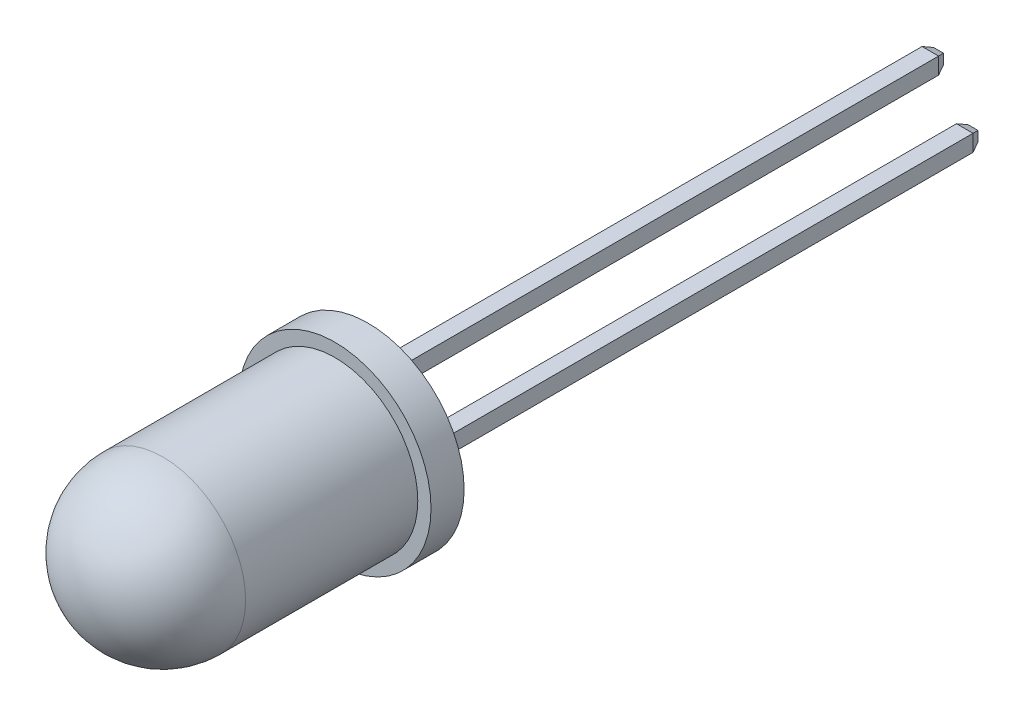
ISO-10303-21;
HEADER;
FILE_DESCRIPTION(('STEP AP214'),'2;1');
FILE_NAME('part.step','',(''),(''),'','','');
FILE_SCHEMA(('AUTOMOTIVE_DESIGN { 1 0 10303 214 1 1 1 1 }'));
ENDSEC;
DATA;
#1=APPLICATION_CONTEXT('core data for automotive mechanical design processes');
#2=APPLICATION_PROTOCOL_DEFINITION('international standard','automotive_design',2000,#1);
#3=PRODUCT_CONTEXT('',#1,'mechanical');
#4=PRODUCT('Part','Part','',(#3));
#5=PRODUCT_RELATED_PRODUCT_CATEGORY('part','',(#4));
#6=PRODUCT_DEFINITION_FORMATION('','',#4);
#7=PRODUCT_DEFINITION_CONTEXT('part definition',#1,'design');
#8=PRODUCT_DEFINITION('design','',#6,#7);
#9=PRODUCT_DEFINITION_SHAPE('','',#8);
#10=(LENGTH_UNIT() NAMED_UNIT(*) SI_UNIT(.MILLI.,.METRE.));
#11=(NAMED_UNIT(*) PLANE_ANGLE_UNIT() SI_UNIT($,.RADIAN.));
#12=(NAMED_UNIT(*) SI_UNIT($,.STERADIAN.) SOLID_ANGLE_UNIT());
#13=UNCERTAINTY_MEASURE_WITH_UNIT(LENGTH_MEASURE(1.E-05),#10,'distance_accuracy_value','');
#14=(GEOMETRIC_REPRESENTATION_CONTEXT(3) GLOBAL_UNCERTAINTY_ASSIGNED_CONTEXT((#13)) GLOBAL_UNIT_ASSIGNED_CONTEXT((#10,
#11,#12)) REPRESENTATION_CONTEXT('',''));
#15=CARTESIAN_POINT('',(0.,0.,0.));
#16=DIRECTION('',(0.,0.,1.));
#17=DIRECTION('',(1.,0.,0.));
#18=AXIS2_PLACEMENT_3D('',#15,#16,#17);
#19=CARTESIAN_POINT('',(0.,0.,0.));
#20=DIRECTION('',(0.,0.,1.));
#21=DIRECTION('',(1.,0.,0.));
#22=AXIS2_PLACEMENT_3D('',#19,#20,#21);
#23=SPHERICAL_SURFACE('',#22,2.5);
#24=CARTESIAN_POINT('',(0.,0.,0.));
#25=DIRECTION('',(0.,0.,-1.));
#26=DIRECTION('',(1.,0.,0.));
#27=AXIS2_PLACEMENT_3D('',#24,#25,#26);
#28=CIRCLE('',#27,2.5);
#29=CARTESIAN_POINT('',(-2.5,0.,0.));
#30=VERTEX_POINT('',#29);
#31=CARTESIAN_POINT('',(2.5,0.,0.));
#32=VERTEX_POINT('',#31);
#33=EDGE_CURVE('P0_E26',#30,#32,#28,.T.);
#34=ORIENTED_EDGE('',*,*,#33,.F.);
#35=CARTESIAN_POINT('',(0.,0.,0.));
#36=DIRECTION('',(0.,-1.,0.));
#37=DIRECTION('',(-1.,0.,0.));
#38=AXIS2_PLACEMENT_3D('',#35,#36,#37);
#39=CIRCLE('',#38,2.5);
#40=CARTESIAN_POINT('',(0.,0.,2.5));
#41=VERTEX_POINT('',#40);
#42=EDGE_CURVE('P0_E11',#41,#30,#39,.T.);
#43=ORIENTED_EDGE('',*,*,#42,.F.);
#44=ORIENTED_EDGE('',*,*,#42,.T.);
#45=CARTESIAN_POINT('',(0.,0.,0.));
#46=DIRECTION('',(0.,0.,-1.));
#47=DIRECTION('',(1.,0.,0.));
#48=AXIS2_PLACEMENT_3D('',#45,#46,#47);
#49=CIRCLE('',#48,2.5);
#50=EDGE_CURVE('P0_E70',#32,#30,#49,.T.);
#51=ORIENTED_EDGE('',*,*,#50,.F.);
#52=EDGE_LOOP('',(#34,#43,#44,#51));
#53=FACE_BOUND('',#52,.T.);
#54=ADVANCED_FACE('P0_F16',(#53),#23,.T.);
#55=CARTESIAN_POINT('',(0.,0.,-2.6));
#56=DIRECTION('',(0.,0.,-1.));
#57=DIRECTION('',(-1.,0.,0.));
#58=AXIS2_PLACEMENT_3D('',#55,#56,#57);
#59=CYLINDRICAL_SURFACE('',#58,2.5);
#60=CARTESIAN_POINT('',(0.,0.,-5.2));
#61=DIRECTION('',(0.,0.,-1.));
#62=DIRECTION('',(1.,0.,0.));
#63=AXIS2_PLACEMENT_3D('',#60,#61,#62);
#64=CIRCLE('',#63,2.5);
#65=CARTESIAN_POINT('',(2.5,0.,-5.2));
#66=VERTEX_POINT('',#65);
#67=EDGE_CURVE('P0_E67',#66,#66,#64,.T.);
#68=ORIENTED_EDGE('',*,*,#67,.F.);
#69=DIRECTION('',(0.,0.,1.));
#70=VECTOR('',#69,1.);
#71=CARTESIAN_POINT('',(2.5,0.,-2.6));
#72=LINE('',#71,#70);
#73=EDGE_CURVE('P0_E64',#66,#32,#72,.T.);
#74=ORIENTED_EDGE('',*,*,#73,.T.);
#75=ORIENTED_EDGE('',*,*,#50,.T.);
#76=ORIENTED_EDGE('',*,*,#33,.T.);
#77=ORIENTED_EDGE('',*,*,#73,.F.);
#78=EDGE_LOOP('',(#68,#74,#75,#76,#77));
#79=FACE_BOUND('',#78,.T.);
#80=ADVANCED_FACE('P0_F66',(#79),#59,.T.);
#81=CARTESIAN_POINT('',(-2.9,0.,-5.2));
#82=DIRECTION('',(0.,0.,1.));
#83=DIRECTION('',(1.,0.,0.));
#84=AXIS2_PLACEMENT_3D('',#81,#82,#83);
#85=PLANE('',#84);
#86=ORIENTED_EDGE('',*,*,#67,.T.);
#87=EDGE_LOOP('',(#86));
#88=FACE_BOUND('',#87,.T.);
#89=CARTESIAN_POINT('',(0.,0.,-5.2));
#90=DIRECTION('',(0.,0.,-1.));
#91=DIRECTION('',(1.,0.,0.));
#92=AXIS2_PLACEMENT_3D('',#89,#90,#91);
#93=CIRCLE('',#92,2.9);
#94=CARTESIAN_POINT('',(2.9,0.,-5.2));
#95=VERTEX_POINT('',#94);
#96=EDGE_CURVE('P0_E20',#95,#95,#93,.T.);
#97=ORIENTED_EDGE('',*,*,#96,.F.);
#98=EDGE_LOOP('',(#97));
#99=FACE_BOUND('',#98,.T.);
#100=ADVANCED_FACE('P0_F18',(#88,#99),#85,.T.);
#101=CARTESIAN_POINT('',(0.,0.,-5.7));
#102=DIRECTION('',(0.,0.,-1.));
#103=DIRECTION('',(-1.,0.,0.));
#104=AXIS2_PLACEMENT_3D('',#101,#102,#103);
#105=CYLINDRICAL_SURFACE('',#104,2.9);
#106=CARTESIAN_POINT('',(0.,0.,-6.2));
#107=DIRECTION('',(0.,0.,-1.));
#108=DIRECTION('',(1.,0.,0.));
#109=AXIS2_PLACEMENT_3D('',#106,#107,#108);
#110=CIRCLE('',#109,2.9);
#111=CARTESIAN_POINT('',(2.9,0.,-6.2));
#112=VERTEX_POINT('',#111);
#113=EDGE_CURVE('P0_E86',#112,#112,#110,.T.);
#114=ORIENTED_EDGE('',*,*,#113,.F.);
#115=DIRECTION('',(0.,0.,1.));
#116=VECTOR('',#115,1.);
#117=CARTESIAN_POINT('',(2.9,0.,-5.7));
#118=LINE('',#117,#116);
#119=EDGE_CURVE('P0_E79',#112,#95,#118,.T.);
#120=ORIENTED_EDGE('',*,*,#119,.T.);
#121=ORIENTED_EDGE('',*,*,#96,.T.);
#122=ORIENTED_EDGE('',*,*,#119,.F.);
#123=EDGE_LOOP('',(#114,#120,#121,#122));
#124=FACE_BOUND('',#123,.T.);
#125=ADVANCED_FACE('P0_F93',(#124),#105,.T.);
#126=CARTESIAN_POINT('',(0.,0.,-6.2));
#127=DIRECTION('',(0.,0.,-1.));
#128=DIRECTION('',(0.,-1.,0.));
#129=AXIS2_PLACEMENT_3D('',#126,#127,#128);
#130=PLANE('',#129);
#131=ORIENTED_EDGE('',*,*,#113,.T.);
#132=EDGE_LOOP('',(#131));
#133=FACE_BOUND('',#132,.T.);
#134=ADVANCED_FACE('P0_F92',(#133),#130,.T.);
#135=CLOSED_SHELL('',(#54,#80,#100,#125,#134));
#136=MANIFOLD_SOLID_BREP('P0_B1',#135);
#137=CARTESIAN_POINT('',(-1.02,-0.249999953433879,-6.2));
#138=DIRECTION('',(0.,-1.,0.));
#139=DIRECTION('',(0.,0.,-1.));
#140=AXIS2_PLACEMENT_3D('',#137,#138,#139);
#141=PLANE('',#140);
#142=DIRECTION('',(-1.,0.,0.));
#143=VECTOR('',#142,1.);
#144=CARTESIAN_POINT('',(-1.145,-0.249999953433879,-24.45));
#145=LINE('',#144,#143);
#146=CARTESIAN_POINT('',(-1.02,-0.249999953433879,-24.45));
#147=VERTEX_POINT('',#146);
#148=CARTESIAN_POINT('',(-1.52,-0.249999953433879,-24.45));
#149=VERTEX_POINT('',#148);
#150=EDGE_CURVE('P1_E245',#147,#149,#145,.T.);
#151=ORIENTED_EDGE('',*,*,#150,.F.);
#152=DIRECTION('',(0.,0.,-1.));
#153=VECTOR('',#152,1.);
#154=CARTESIAN_POINT('',(-1.02,-0.249999953433879,-6.2));
#155=LINE('',#154,#153);
#156=CARTESIAN_POINT('',(-1.02,-0.249999953433879,-6.2));
#157=VERTEX_POINT('',#156);
#158=EDGE_CURVE('P1_E40',#157,#147,#155,.T.);
#159=ORIENTED_EDGE('',*,*,#158,.F.);
#160=DIRECTION('',(0.00909052693064519,0.,0.999958680306403));
#161=VECTOR('',#160,1.);
#162=CARTESIAN_POINT('',(-1.00000001490116,-0.25,-4.00000005960464));
#163=LINE('',#162,#161);
#164=CARTESIAN_POINT('',(-1.00000001490116,-0.25,-4.00000005960464));
#165=VERTEX_POINT('',#164);
#166=EDGE_CURVE('P1_E150',#157,#165,#163,.T.);
#167=ORIENTED_EDGE('',*,*,#166,.T.);
#168=DIRECTION('',(1.,0.,0.));
#169=VECTOR('',#168,1.);
#170=CARTESIAN_POINT('',(-0.279064603238777,-0.25,-4.00000005960464));
#171=LINE('',#170,#169);
#172=CARTESIAN_POINT('',(-0.279064603238777,-0.25,-4.00000005960464));
#173=VERTEX_POINT('',#172);
#174=EDGE_CURVE('P1_E167',#165,#173,#171,.T.);
#175=ORIENTED_EDGE('',*,*,#174,.T.);
#176=DIRECTION('',(-0.523156160420928,0.,0.852236840211471));
#177=VECTOR('',#176,1.);
#178=CARTESIAN_POINT('',(-0.999999977648259,-0.25,-2.82557503708544));
#179=LINE('',#178,#177);
#180=CARTESIAN_POINT('',(-0.999999977648259,-0.25,-2.82557503708544));
#181=VERTEX_POINT('',#180);
#182=EDGE_CURVE('P1_E293',#173,#181,#179,.T.);
#183=ORIENTED_EDGE('',*,*,#182,.T.);
#184=DIRECTION('',(0.,0.,1.));
#185=VECTOR('',#184,1.);
#186=CARTESIAN_POINT('',(-0.999999977648258,-0.25,-2.35925807482562));
#187=LINE('',#186,#185);
#188=CARTESIAN_POINT('',(-0.999999977648258,-0.25,-2.35925807482562));
#189=VERTEX_POINT('',#188);
#190=EDGE_CURVE('P1_E178',#181,#189,#187,.T.);
#191=ORIENTED_EDGE('',*,*,#190,.T.);
#192=DIRECTION('',(-1.,0.,0.));
#193=VECTOR('',#192,1.);
#194=CARTESIAN_POINT('',(-1.76000001490117,-0.25,-2.35925807482562));
#195=LINE('',#194,#193);
#196=CARTESIAN_POINT('',(-1.76000001490117,-0.25,-2.35925807482562));
#197=VERTEX_POINT('',#196);
#198=EDGE_CURVE('P1_E199',#189,#197,#195,.T.);
#199=ORIENTED_EDGE('',*,*,#198,.T.);
#200=DIRECTION('',(0.,0.,-1.));
#201=VECTOR('',#200,1.);
#202=CARTESIAN_POINT('',(-1.76000001490116,-0.25,-4.00000005960465));
#203=LINE('',#202,#201);
#204=CARTESIAN_POINT('',(-1.76000001490116,-0.25,-4.00000005960465));
#205=VERTEX_POINT('',#204);
#206=EDGE_CURVE('P1_E207',#197,#205,#203,.T.);
#207=ORIENTED_EDGE('',*,*,#206,.T.);
#208=DIRECTION('',(-1.,0.,0.));
#209=VECTOR('',#208,1.);
#210=CARTESIAN_POINT('',(-2.00000002980232,-0.25,-4.00000005960464));
#211=LINE('',#210,#209);
#212=CARTESIAN_POINT('',(-2.00000002980232,-0.25,-4.00000005960464));
#213=VERTEX_POINT('',#212);
#214=EDGE_CURVE('P1_E256',#205,#213,#211,.T.);
#215=ORIENTED_EDGE('',*,*,#214,.T.);
#216=DIRECTION('',(0.,0.,-1.));
#217=VECTOR('',#216,1.);
#218=CARTESIAN_POINT('',(-2.00000002980232,-0.25,-5.00000007450581));
#219=LINE('',#218,#217);
#220=CARTESIAN_POINT('',(-2.00000002980232,-0.25,-5.00000007450581));
#221=VERTEX_POINT('',#220);
#222=EDGE_CURVE('P1_E224',#213,#221,#219,.T.);
#223=ORIENTED_EDGE('',*,*,#222,.T.);
#224=DIRECTION('',(1.,0.,0.));
#225=VECTOR('',#224,1.);
#226=CARTESIAN_POINT('',(-1.52,-0.25,-5.00000007450581));
#227=LINE('',#226,#225);
#228=CARTESIAN_POINT('',(-1.52,-0.25,-5.00000007450581));
#229=VERTEX_POINT('',#228);
#230=EDGE_CURVE('P1_E188',#221,#229,#227,.T.);
#231=ORIENTED_EDGE('',*,*,#230,.T.);
#232=DIRECTION('',(0.,0.,-1.));
#233=VECTOR('',#232,1.);
#234=CARTESIAN_POINT('',(-1.52,-0.25,-6.2));
#235=LINE('',#234,#233);
#236=EDGE_CURVE('P1_E11',#229,#149,#235,.T.);
#237=ORIENTED_EDGE('',*,*,#236,.T.);
#238=EDGE_LOOP('',(#151,#159,#167,#175,#183,#191,#199,#207,#215,#223,#231,#237));
#239=FACE_BOUND('',#238,.T.);
#240=ADVANCED_FACE('P1_F16',(#239),#141,.T.);
#241=CARTESIAN_POINT('',(-1.52,-0.249999953433879,-6.2));
#242=DIRECTION('',(-1.,0.,0.));
#243=DIRECTION('',(0.,0.,1.));
#244=AXIS2_PLACEMENT_3D('',#241,#242,#243);
#245=PLANE('',#244);
#246=DIRECTION('',(0.,1.,0.));
#247=VECTOR('',#246,1.);
#248=CARTESIAN_POINT('',(-1.52,-0.124999976716939,-24.45));
#249=LINE('',#248,#247);
#250=CARTESIAN_POINT('',(-1.52,0.249999953433879,-24.45));
#251=VERTEX_POINT('',#250);
#252=EDGE_CURVE('P1_E193',#149,#251,#249,.T.);
#253=ORIENTED_EDGE('',*,*,#252,.F.);
#254=ORIENTED_EDGE('',*,*,#236,.F.);
#255=DIRECTION('',(0.,1.,0.));
#256=VECTOR('',#255,1.);
#257=CARTESIAN_POINT('',(-1.52,0.,-5.00000007450581));
#258=LINE('',#257,#256);
#259=CARTESIAN_POINT('',(-1.52,0.25,-5.00000007450581));
#260=VERTEX_POINT('',#259);
#261=EDGE_CURVE('P1_E184',#229,#260,#258,.T.);
#262=ORIENTED_EDGE('',*,*,#261,.T.);
#263=DIRECTION('',(0.,0.,1.));
#264=VECTOR('',#263,1.);
#265=CARTESIAN_POINT('',(-1.52,0.25,-6.2));
#266=LINE('',#265,#264);
#267=EDGE_CURVE('P1_E27',#251,#260,#266,.T.);
#268=ORIENTED_EDGE('',*,*,#267,.F.);
#269=EDGE_LOOP('',(#253,#254,#262,#268));
#270=FACE_BOUND('',#269,.T.);
#271=ADVANCED_FACE('P1_F440',(#270),#245,.T.);
#272=CARTESIAN_POINT('',(-1.27,0.,-24.7));
#273=DIRECTION('',(0.,0.,-1.));
#274=DIRECTION('',(0.,-1.,0.));
#275=AXIS2_PLACEMENT_3D('',#272,#273,#274);
#276=PLANE('',#275);
#277=DIRECTION('',(-1.,0.,0.));
#278=VECTOR('',#277,1.);
#279=CARTESIAN_POINT('',(-1.395,0.149999953433879,-24.7));
#280=LINE('',#279,#278);
#281=CARTESIAN_POINT('',(-1.12,0.149999953433879,-24.7));
#282=VERTEX_POINT('',#281);
#283=CARTESIAN_POINT('',(-1.42,0.149999953433879,-24.7));
#284=VERTEX_POINT('',#283);
#285=EDGE_CURVE('P1_E192',#282,#284,#280,.T.);
#286=ORIENTED_EDGE('',*,*,#285,.F.);
#287=DIRECTION('',(0.,1.,0.));
#288=VECTOR('',#287,1.);
#289=CARTESIAN_POINT('',(-1.12,0.124999976716939,-24.7));
#290=LINE('',#289,#288);
#291=CARTESIAN_POINT('',(-1.12,-0.149999953433879,-24.7));
#292=VERTEX_POINT('',#291);
#293=EDGE_CURVE('P1_E217',#292,#282,#290,.T.);
#294=ORIENTED_EDGE('',*,*,#293,.F.);
#295=DIRECTION('',(1.,0.,0.));
#296=VECTOR('',#295,1.);
#297=CARTESIAN_POINT('',(-1.145,-0.149999953433879,-24.7));
#298=LINE('',#297,#296);
#299=CARTESIAN_POINT('',(-1.42,-0.149999953433879,-24.7));
#300=VERTEX_POINT('',#299);
#301=EDGE_CURVE('P1_E197',#300,#292,#298,.T.);
#302=ORIENTED_EDGE('',*,*,#301,.F.);
#303=DIRECTION('',(0.,-1.,0.));
#304=VECTOR('',#303,1.);
#305=CARTESIAN_POINT('',(-1.42,-0.124999976716939,-24.7));
#306=LINE('',#305,#304);
#307=EDGE_CURVE('P1_E235',#284,#300,#306,.T.);
#308=ORIENTED_EDGE('',*,*,#307,.F.);
#309=EDGE_LOOP('',(#286,#294,#302,#308));
#310=FACE_BOUND('',#309,.T.);
#311=ADVANCED_FACE('P1_F273',(#310),#276,.T.);
#312=CARTESIAN_POINT('',(-1.52,0.249999953433879,-6.2));
#313=DIRECTION('',(0.,1.,0.));
#314=DIRECTION('',(1.,0.,0.));
#315=AXIS2_PLACEMENT_3D('',#312,#313,#314);
#316=PLANE('',#315);
#317=DIRECTION('',(1.,0.,0.));
#318=VECTOR('',#317,1.);
#319=CARTESIAN_POINT('',(-1.395,0.249999953433879,-24.45));
#320=LINE('',#319,#318);
#321=CARTESIAN_POINT('',(-1.02,0.249999953433879,-24.45));
#322=VERTEX_POINT('',#321);
#323=EDGE_CURVE('P1_E244',#251,#322,#320,.T.);
#324=ORIENTED_EDGE('',*,*,#323,.F.);
#325=ORIENTED_EDGE('',*,*,#267,.T.);
#326=DIRECTION('',(-1.,0.,0.));
#327=VECTOR('',#326,1.);
#328=CARTESIAN_POINT('',(-1.52,0.25,-5.00000007450581));
#329=LINE('',#328,#327);
#330=CARTESIAN_POINT('',(-2.00000002980232,0.25,-5.00000007450581));
#331=VERTEX_POINT('',#330);
#332=EDGE_CURVE('P1_E189',#260,#331,#329,.T.);
#333=ORIENTED_EDGE('',*,*,#332,.T.);
#334=DIRECTION('',(0.,0.,1.));
#335=VECTOR('',#334,1.);
#336=CARTESIAN_POINT('',(-2.00000002980232,0.25,-5.00000007450581));
#337=LINE('',#336,#335);
#338=CARTESIAN_POINT('',(-2.00000002980232,0.25,-4.00000005960464));
#339=VERTEX_POINT('',#338);
#340=EDGE_CURVE('P1_E225',#331,#339,#337,.T.);
#341=ORIENTED_EDGE('',*,*,#340,.T.);
#342=DIRECTION('',(1.,0.,0.));
#343=VECTOR('',#342,1.);
#344=CARTESIAN_POINT('',(-2.00000002980232,0.25,-4.00000005960464));
#345=LINE('',#344,#343);
#346=CARTESIAN_POINT('',(-1.76000001490116,0.25,-4.00000005960465));
#347=VERTEX_POINT('',#346);
#348=EDGE_CURVE('P1_E20',#339,#347,#345,.T.);
#349=ORIENTED_EDGE('',*,*,#348,.T.);
#350=DIRECTION('',(0.,0.,1.));
#351=VECTOR('',#350,1.);
#352=CARTESIAN_POINT('',(-1.76000001490116,0.25,-4.00000005960465));
#353=LINE('',#352,#351);
#354=CARTESIAN_POINT('',(-1.76000001490117,0.25,-2.35925807482562));
#355=VERTEX_POINT('',#354);
#356=EDGE_CURVE('P1_E203',#347,#355,#353,.T.);
#357=ORIENTED_EDGE('',*,*,#356,.T.);
#358=DIRECTION('',(1.,0.,0.));
#359=VECTOR('',#358,1.);
#360=CARTESIAN_POINT('',(-1.76000001490117,0.25,-2.35925807482562));
#361=LINE('',#360,#359);
#362=CARTESIAN_POINT('',(-0.999999977648258,0.25,-2.35925807482562));
#363=VERTEX_POINT('',#362);
#364=EDGE_CURVE('P1_E182',#355,#363,#361,.T.);
#365=ORIENTED_EDGE('',*,*,#364,.T.);
#366=DIRECTION('',(0.,0.,-1.));
#367=VECTOR('',#366,1.);
#368=CARTESIAN_POINT('',(-0.999999977648258,0.25,-2.35925807482562));
#369=LINE('',#368,#367);
#370=CARTESIAN_POINT('',(-0.999999977648259,0.25,-2.82557503708544));
#371=VERTEX_POINT('',#370);
#372=EDGE_CURVE('P1_E297',#363,#371,#369,.T.);
#373=ORIENTED_EDGE('',*,*,#372,.T.);
#374=DIRECTION('',(0.523156160420928,0.,-0.852236840211471));
#375=VECTOR('',#374,1.);
#376=CARTESIAN_POINT('',(-0.999999977648259,0.25,-2.82557503708544));
#377=LINE('',#376,#375);
#378=CARTESIAN_POINT('',(-0.279064603238777,0.25,-4.00000005960464));
#379=VERTEX_POINT('',#378);
#380=EDGE_CURVE('P1_E157',#371,#379,#377,.T.);
#381=ORIENTED_EDGE('',*,*,#380,.T.);
#382=DIRECTION('',(-1.,0.,0.));
#383=VECTOR('',#382,1.);
#384=CARTESIAN_POINT('',(-0.279064603238777,0.25,-4.00000005960464));
#385=LINE('',#384,#383);
#386=CARTESIAN_POINT('',(-1.00000001490116,0.25,-4.00000005960464));
#387=VERTEX_POINT('',#386);
#388=EDGE_CURVE('P1_E153',#379,#387,#385,.T.);
#389=ORIENTED_EDGE('',*,*,#388,.T.);
#390=DIRECTION('',(-0.00909052693064519,0.,-0.999958680306403));
#391=VECTOR('',#390,1.);
#392=CARTESIAN_POINT('',(-1.00000001490116,0.25,-4.00000005960464));
#393=LINE('',#392,#391);
#394=CARTESIAN_POINT('',(-1.02,0.249999953433879,-6.2));
#395=VERTEX_POINT('',#394);
#396=EDGE_CURVE('P1_E141',#387,#395,#393,.T.);
#397=ORIENTED_EDGE('',*,*,#396,.T.);
#398=DIRECTION('',(0.,0.,-1.));
#399=VECTOR('',#398,1.);
#400=CARTESIAN_POINT('',(-1.02,0.249999953433879,-6.2));
#401=LINE('',#400,#399);
#402=EDGE_CURVE('P1_E214',#395,#322,#401,.T.);
#403=ORIENTED_EDGE('',*,*,#402,.T.);
#404=EDGE_LOOP('',(#324,#325,#333,#341,#349,#357,#365,#373,#381,#389,#397,#403));
#405=FACE_BOUND('',#404,.T.);
#406=ADVANCED_FACE('P1_F155',(#405),#316,.T.);
#407=CARTESIAN_POINT('',(-1.02,0.249999953433879,-6.2));
#408=DIRECTION('',(1.,0.,0.));
#409=DIRECTION('',(0.,1.,0.));
#410=AXIS2_PLACEMENT_3D('',#407,#408,#409);
#411=PLANE('',#410);
#412=DIRECTION('',(0.,-1.,0.));
#413=VECTOR('',#412,1.);
#414=CARTESIAN_POINT('',(-1.02,0.124999976716939,-24.45));
#415=LINE('',#414,#413);
#416=EDGE_CURVE('P1_E249',#322,#147,#415,.T.);
#417=ORIENTED_EDGE('',*,*,#416,.F.);
#418=ORIENTED_EDGE('',*,*,#402,.F.);
#419=DIRECTION('',(0.,1.,0.));
#420=VECTOR('',#419,1.);
#421=CARTESIAN_POINT('',(-1.02,0.124999976716939,-6.2));
#422=LINE('',#421,#420);
#423=EDGE_CURVE('P1_E147',#157,#395,#422,.T.);
#424=ORIENTED_EDGE('',*,*,#423,.F.);
#425=ORIENTED_EDGE('',*,*,#158,.T.);
#426=EDGE_LOOP('',(#417,#418,#424,#425));
#427=FACE_BOUND('',#426,.T.);
#428=ADVANCED_FACE('P1_F425',(#427),#411,.T.);
#429=CARTESIAN_POINT('',(-1.07,0.124999976716939,-24.575));
#430=DIRECTION('',(0.928476690885259,0.,-0.371390676354105));
#431=DIRECTION('',(0.,-1.,0.));
#432=AXIS2_PLACEMENT_3D('',#429,#430,#431);
#433=PLANE('',#432);
#434=ORIENTED_EDGE('',*,*,#416,.T.);
#435=DIRECTION('',(0.348155311911396,-0.348155311911397,0.870388279778489));
#436=VECTOR('',#435,1.);
#437=CARTESIAN_POINT('',(-1.12,-0.149999953433879,-24.7));
#438=LINE('',#437,#436);
#439=EDGE_CURVE('P1_E231',#292,#147,#438,.T.);
#440=ORIENTED_EDGE('',*,*,#439,.F.);
#441=ORIENTED_EDGE('',*,*,#293,.T.);
#442=DIRECTION('',(0.348155311911396,0.348155311911397,0.870388279778488));
#443=VECTOR('',#442,1.);
#444=CARTESIAN_POINT('',(-1.12,0.149999953433879,-24.7));
#445=LINE('',#444,#443);
#446=EDGE_CURVE('P1_E239',#282,#322,#445,.T.);
#447=ORIENTED_EDGE('',*,*,#446,.T.);
#448=EDGE_LOOP('',(#434,#440,#441,#447));
#449=FACE_BOUND('',#448,.T.);
#450=ADVANCED_FACE('P1_F263',(#449),#433,.T.);
#451=CARTESIAN_POINT('',(-1.145,-0.199999953433879,-24.575));
#452=DIRECTION('',(0.,-0.928476690885259,-0.371390676354105));
#453=DIRECTION('',(0.,0.371390676354105,-0.928476690885259));
#454=AXIS2_PLACEMENT_3D('',#451,#452,#453);
#455=PLANE('',#454);
#456=ORIENTED_EDGE('',*,*,#301,.T.);
#457=ORIENTED_EDGE('',*,*,#439,.T.);
#458=ORIENTED_EDGE('',*,*,#150,.T.);
#459=DIRECTION('',(-0.348155311911397,-0.348155311911397,0.870388279778488));
#460=VECTOR('',#459,1.);
#461=CARTESIAN_POINT('',(-1.42,-0.149999953433879,-24.7));
#462=LINE('',#461,#460);
#463=EDGE_CURVE('P1_E198',#300,#149,#462,.T.);
#464=ORIENTED_EDGE('',*,*,#463,.F.);
#465=EDGE_LOOP('',(#456,#457,#458,#464));
#466=FACE_BOUND('',#465,.T.);
#467=ADVANCED_FACE('P1_F424',(#466),#455,.T.);
#468=CARTESIAN_POINT('',(-1.47,-0.124999976716939,-24.575));
#469=DIRECTION('',(-0.928476690885259,0.,-0.371390676354105));
#470=DIRECTION('',(-0.371390676354105,0.,0.928476690885259));
#471=AXIS2_PLACEMENT_3D('',#468,#469,#470);
#472=PLANE('',#471);
#473=ORIENTED_EDGE('',*,*,#307,.T.);
#474=ORIENTED_EDGE('',*,*,#463,.T.);
#475=ORIENTED_EDGE('',*,*,#252,.T.);
#476=DIRECTION('',(-0.348155311911397,0.348155311911396,0.870388279778488));
#477=VECTOR('',#476,1.);
#478=CARTESIAN_POINT('',(-1.42,0.149999953433879,-24.7));
#479=LINE('',#478,#477);
#480=EDGE_CURVE('P1_E240',#284,#251,#479,.T.);
#481=ORIENTED_EDGE('',*,*,#480,.F.);
#482=EDGE_LOOP('',(#473,#474,#475,#481));
#483=FACE_BOUND('',#482,.T.);
#484=ADVANCED_FACE('P1_F18',(#483),#472,.T.);
#485=CARTESIAN_POINT('',(-1.395,0.199999953433879,-24.575));
#486=DIRECTION('',(0.,0.928476690885259,-0.371390676354105));
#487=DIRECTION('',(-1.,0.,0.));
#488=AXIS2_PLACEMENT_3D('',#485,#486,#487);
#489=PLANE('',#488);
#490=ORIENTED_EDGE('',*,*,#285,.T.);
#491=ORIENTED_EDGE('',*,*,#480,.T.);
#492=ORIENTED_EDGE('',*,*,#323,.T.);
#493=ORIENTED_EDGE('',*,*,#446,.F.);
#494=EDGE_LOOP('',(#490,#491,#492,#493));
#495=FACE_BOUND('',#494,.T.);
#496=ADVANCED_FACE('P1_F270',(#495),#489,.T.);
#497=CARTESIAN_POINT('',(-1.00000001490116,0.,-4.00000005960464));
#498=DIRECTION('',(0.999958680306403,0.,-0.00909052693064519));
#499=DIRECTION('',(0.,-1.,0.));
#500=AXIS2_PLACEMENT_3D('',#497,#498,#499);
#501=PLANE('',#500);
#502=ORIENTED_EDGE('',*,*,#423,.T.);
#503=ORIENTED_EDGE('',*,*,#396,.F.);
#504=DIRECTION('',(0.,-1.,0.));
#505=VECTOR('',#504,1.);
#506=CARTESIAN_POINT('',(-1.00000001490116,0.,-4.00000005960464));
#507=LINE('',#506,#505);
#508=EDGE_CURVE('P1_E146',#387,#165,#507,.T.);
#509=ORIENTED_EDGE('',*,*,#508,.T.);
#510=ORIENTED_EDGE('',*,*,#166,.F.);
#511=EDGE_LOOP('',(#502,#503,#509,#510));
#512=FACE_BOUND('',#511,.T.);
#513=ADVANCED_FACE('P1_F143',(#512),#501,.T.);
#514=CARTESIAN_POINT('',(-1.52,0.,-5.00000007450581));
#515=DIRECTION('',(0.,0.,-1.));
#516=DIRECTION('',(0.,-1.,0.));
#517=AXIS2_PLACEMENT_3D('',#514,#515,#516);
#518=PLANE('',#517);
#519=DIRECTION('',(0.,1.,0.));
#520=VECTOR('',#519,1.);
#521=CARTESIAN_POINT('',(-2.00000002980232,0.,-5.00000007450581));
#522=LINE('',#521,#520);
#523=EDGE_CURVE('P1_E220',#221,#331,#522,.T.);
#524=ORIENTED_EDGE('',*,*,#523,.T.);
#525=ORIENTED_EDGE('',*,*,#332,.F.);
#526=ORIENTED_EDGE('',*,*,#261,.F.);
#527=ORIENTED_EDGE('',*,*,#230,.F.);
#528=EDGE_LOOP('',(#524,#525,#526,#527));
#529=FACE_BOUND('',#528,.T.);
#530=ADVANCED_FACE('P1_F339',(#529),#518,.T.);
#531=CARTESIAN_POINT('',(-2.00000002980232,0.,-5.00000007450581));
#532=DIRECTION('',(-1.,0.,0.));
#533=DIRECTION('',(0.,1.,0.));
#534=AXIS2_PLACEMENT_3D('',#531,#532,#533);
#535=PLANE('',#534);
#536=DIRECTION('',(0.,1.,0.));
#537=VECTOR('',#536,1.);
#538=CARTESIAN_POINT('',(-2.00000002980232,0.,-4.00000005960464));
#539=LINE('',#538,#537);
#540=EDGE_CURVE('P1_E252',#213,#339,#539,.T.);
#541=ORIENTED_EDGE('',*,*,#540,.T.);
#542=ORIENTED_EDGE('',*,*,#340,.F.);
#543=ORIENTED_EDGE('',*,*,#523,.F.);
#544=ORIENTED_EDGE('',*,*,#222,.F.);
#545=EDGE_LOOP('',(#541,#542,#543,#544));
#546=FACE_BOUND('',#545,.T.);
#547=ADVANCED_FACE('P1_F324',(#546),#535,.T.);
#548=CARTESIAN_POINT('',(-2.00000002980232,0.,-4.00000005960464));
#549=DIRECTION('',(0.,0.,1.));
#550=DIRECTION('',(1.,0.,0.));
#551=AXIS2_PLACEMENT_3D('',#548,#549,#550);
#552=PLANE('',#551);
#553=DIRECTION('',(0.,1.,0.));
#554=VECTOR('',#553,1.);
#555=CARTESIAN_POINT('',(-1.76000001490116,0.,-4.00000005960465));
#556=LINE('',#555,#554);
#557=EDGE_CURVE('P1_E210',#205,#347,#556,.T.);
#558=ORIENTED_EDGE('',*,*,#557,.T.);
#559=ORIENTED_EDGE('',*,*,#348,.F.);
#560=ORIENTED_EDGE('',*,*,#540,.F.);
#561=ORIENTED_EDGE('',*,*,#214,.F.);
#562=EDGE_LOOP('',(#558,#559,#560,#561));
#563=FACE_BOUND('',#562,.T.);
#564=ADVANCED_FACE('P1_F326',(#563),#552,.T.);
#565=CARTESIAN_POINT('',(-1.76000001490116,0.,-4.00000005960465));
#566=DIRECTION('',(-1.,0.,0.));
#567=DIRECTION('',(0.,0.,1.));
#568=AXIS2_PLACEMENT_3D('',#565,#566,#567);
#569=PLANE('',#568);
#570=DIRECTION('',(0.,1.,0.));
#571=VECTOR('',#570,1.);
#572=CARTESIAN_POINT('',(-1.76000001490117,0.,-2.35925807482562));
#573=LINE('',#572,#571);
#574=EDGE_CURVE('P1_E204',#197,#355,#573,.T.);
#575=ORIENTED_EDGE('',*,*,#574,.T.);
#576=ORIENTED_EDGE('',*,*,#356,.F.);
#577=ORIENTED_EDGE('',*,*,#557,.F.);
#578=ORIENTED_EDGE('',*,*,#206,.F.);
#579=EDGE_LOOP('',(#575,#576,#577,#578));
#580=FACE_BOUND('',#579,.T.);
#581=ADVANCED_FACE('P1_F353',(#580),#569,.T.);
#582=CARTESIAN_POINT('',(-1.76000001490117,0.,-2.35925807482562));
#583=DIRECTION('',(0.,0.,1.));
#584=DIRECTION('',(1.,0.,0.));
#585=AXIS2_PLACEMENT_3D('',#582,#583,#584);
#586=PLANE('',#585);
#587=DIRECTION('',(0.,1.,0.));
#588=VECTOR('',#587,1.);
#589=CARTESIAN_POINT('',(-0.999999977648258,0.,-2.35925807482562));
#590=LINE('',#589,#588);
#591=EDGE_CURVE('P1_E183',#189,#363,#590,.T.);
#592=ORIENTED_EDGE('',*,*,#591,.T.);
#593=ORIENTED_EDGE('',*,*,#364,.F.);
#594=ORIENTED_EDGE('',*,*,#574,.F.);
#595=ORIENTED_EDGE('',*,*,#198,.F.);
#596=EDGE_LOOP('',(#592,#593,#594,#595));
#597=FACE_BOUND('',#596,.T.);
#598=ADVANCED_FACE('P1_F347',(#597),#586,.T.);
#599=CARTESIAN_POINT('',(-0.999999977648258,0.,-2.35925807482562));
#600=DIRECTION('',(1.,0.,0.));
#601=DIRECTION('',(0.,0.,-1.));
#602=AXIS2_PLACEMENT_3D('',#599,#600,#601);
#603=PLANE('',#602);
#604=DIRECTION('',(0.,1.,0.));
#605=VECTOR('',#604,1.);
#606=CARTESIAN_POINT('',(-0.999999977648259,0.,-2.82557503708544));
#607=LINE('',#606,#605);
#608=EDGE_CURVE('P1_E177',#181,#371,#607,.T.);
#609=ORIENTED_EDGE('',*,*,#608,.T.);
#610=ORIENTED_EDGE('',*,*,#372,.F.);
#611=ORIENTED_EDGE('',*,*,#591,.F.);
#612=ORIENTED_EDGE('',*,*,#190,.F.);
#613=EDGE_LOOP('',(#609,#610,#611,#612));
#614=FACE_BOUND('',#613,.T.);
#615=ADVANCED_FACE('P1_F352',(#614),#603,.T.);
#616=CARTESIAN_POINT('',(-0.999999977648259,0.,-2.82557503708544));
#617=DIRECTION('',(0.852236840211471,0.,0.523156160420928));
#618=DIRECTION('',(0.,-1.,0.));
#619=AXIS2_PLACEMENT_3D('',#616,#617,#618);
#620=PLANE('',#619);
#621=DIRECTION('',(0.,1.,0.));
#622=VECTOR('',#621,1.);
#623=CARTESIAN_POINT('',(-0.279064603238777,0.,-4.00000005960464));
#624=LINE('',#623,#622);
#625=EDGE_CURVE('P1_E162',#173,#379,#624,.T.);
#626=ORIENTED_EDGE('',*,*,#625,.T.);
#627=ORIENTED_EDGE('',*,*,#380,.F.);
#628=ORIENTED_EDGE('',*,*,#608,.F.);
#629=ORIENTED_EDGE('',*,*,#182,.F.);
#630=EDGE_LOOP('',(#626,#627,#628,#629));
#631=FACE_BOUND('',#630,.T.);
#632=ADVANCED_FACE('P1_F373',(#631),#620,.T.);
#633=CARTESIAN_POINT('',(-0.279064603238777,0.,-4.00000005960464));
#634=DIRECTION('',(0.,0.,-1.));
#635=DIRECTION('',(-1.,0.,0.));
#636=AXIS2_PLACEMENT_3D('',#633,#634,#635);
#637=PLANE('',#636);
#638=ORIENTED_EDGE('',*,*,#508,.F.);
#639=ORIENTED_EDGE('',*,*,#388,.F.);
#640=ORIENTED_EDGE('',*,*,#625,.F.);
#641=ORIENTED_EDGE('',*,*,#174,.F.);
#642=EDGE_LOOP('',(#638,#639,#640,#641));
#643=FACE_BOUND('',#642,.T.);
#644=ADVANCED_FACE('P1_F165',(#643),#637,.T.);
#645=CLOSED_SHELL('',(#240,#271,#311,#406,#428,#450,#467,#484,#496,#513,#530,#547,#564,#581,
#598,#615,#632,#644));
#646=MANIFOLD_SOLID_BREP('P1_B1',#645);
#647=CARTESIAN_POINT('',(1.02,0.249999953433879,-6.2));
#648=DIRECTION('',(0.,1.,0.));
#649=DIRECTION('',(1.,0.,0.));
#650=AXIS2_PLACEMENT_3D('',#647,#648,#649);
#651=PLANE('',#650);
#652=DIRECTION('',(1.,0.,0.));
#653=VECTOR('',#652,1.);
#654=CARTESIAN_POINT('',(1.145,0.249999953433879,-22.95));
#655=LINE('',#654,#653);
#656=CARTESIAN_POINT('',(1.02,0.249999953433879,-22.95));
#657=VERTEX_POINT('',#656);
#658=CARTESIAN_POINT('',(1.52,0.249999953433879,-22.95));
#659=VERTEX_POINT('',#658);
#660=EDGE_CURVE('P2_E183',#657,#659,#655,.T.);
#661=ORIENTED_EDGE('',*,*,#660,.F.);
#662=DIRECTION('',(0.,0.,-1.));
#663=VECTOR('',#662,1.);
#664=CARTESIAN_POINT('',(1.02,0.249999953433879,-6.2));
#665=LINE('',#664,#663);
#666=CARTESIAN_POINT('',(1.02,0.25,-4.00000005960464));
#667=VERTEX_POINT('',#666);
#668=EDGE_CURVE('P2_E41',#667,#657,#665,.T.);
#669=ORIENTED_EDGE('',*,*,#668,.F.);
#670=DIRECTION('',(-1.,0.,0.));
#671=VECTOR('',#670,1.);
#672=CARTESIAN_POINT('',(0.344751455826432,0.25,-4.00000005960464));
#673=LINE('',#672,#671);
#674=CARTESIAN_POINT('',(0.344751455826432,0.25,-4.00000005960464));
#675=VERTEX_POINT('',#674);
#676=EDGE_CURVE('P2_E137',#667,#675,#673,.T.);
#677=ORIENTED_EDGE('',*,*,#676,.T.);
#678=DIRECTION('',(-0.523156160420928,0.,0.852236840211471));
#679=VECTOR('',#678,1.);
#680=CARTESIAN_POINT('',(1.02,0.25,-5.09999988600612));
#681=LINE('',#680,#679);
#682=CARTESIAN_POINT('',(-0.399999991059304,0.25,-2.78677795145601));
#683=VERTEX_POINT('',#682);
#684=EDGE_CURVE('P2_E125',#675,#683,#681,.T.);
#685=ORIENTED_EDGE('',*,*,#684,.T.);
#686=DIRECTION('',(0.,0.,1.));
#687=VECTOR('',#686,1.);
#688=CARTESIAN_POINT('',(-0.399999991059304,0.25,-2.78677795145601));
#689=LINE('',#688,#687);
#690=CARTESIAN_POINT('',(-0.399999991059303,0.25,-2.35925807482562));
#691=VERTEX_POINT('',#690);
#692=EDGE_CURVE('P2_E153',#683,#691,#689,.T.);
#693=ORIENTED_EDGE('',*,*,#692,.T.);
#694=DIRECTION('',(1.,0.,0.));
#695=VECTOR('',#694,1.);
#696=CARTESIAN_POINT('',(-0.399999991059303,0.25,-2.35925807482562));
#697=LINE('',#696,#695);
#698=CARTESIAN_POINT('',(1.52,0.25,-2.35925807482562));
#699=VERTEX_POINT('',#698);
#700=EDGE_CURVE('P2_E148',#691,#699,#697,.T.);
#701=ORIENTED_EDGE('',*,*,#700,.T.);
#702=DIRECTION('',(0.,0.,-1.));
#703=VECTOR('',#702,1.);
#704=CARTESIAN_POINT('',(1.52,0.25,-2.35925807482562));
#705=LINE('',#704,#703);
#706=EDGE_CURVE('P2_E11',#699,#659,#705,.T.);
#707=ORIENTED_EDGE('',*,*,#706,.T.);
#708=EDGE_LOOP('',(#661,#669,#677,#685,#693,#701,#707));
#709=FACE_BOUND('',#708,.T.);
#710=ADVANCED_FACE('P2_F16',(#709),#651,.T.);
#711=CARTESIAN_POINT('',(1.52,0.249999953433879,-6.2));
#712=DIRECTION('',(1.,0.,0.));
#713=DIRECTION('',(0.,1.,0.));
#714=AXIS2_PLACEMENT_3D('',#711,#712,#713);
#715=PLANE('',#714);
#716=DIRECTION('',(0.,-1.,0.));
#717=VECTOR('',#716,1.);
#718=CARTESIAN_POINT('',(1.52,0.124999976716939,-22.95));
#719=LINE('',#718,#717);
#720=CARTESIAN_POINT('',(1.52,-0.249999953433879,-22.95));
#721=VERTEX_POINT('',#720);
#722=EDGE_CURVE('P2_E190',#659,#721,#719,.T.);
#723=ORIENTED_EDGE('',*,*,#722,.F.);
#724=ORIENTED_EDGE('',*,*,#706,.F.);
#725=DIRECTION('',(0.,1.,0.));
#726=VECTOR('',#725,1.);
#727=CARTESIAN_POINT('',(1.52,0.,-2.35925807482562));
#728=LINE('',#727,#726);
#729=CARTESIAN_POINT('',(1.52,-0.25,-2.35925807482562));
#730=VERTEX_POINT('',#729);
#731=EDGE_CURVE('P2_E133',#730,#699,#728,.T.);
#732=ORIENTED_EDGE('',*,*,#731,.F.);
#733=DIRECTION('',(0.,0.,1.));
#734=VECTOR('',#733,1.);
#735=CARTESIAN_POINT('',(1.52,-0.25,-2.35925807482562));
#736=LINE('',#735,#734);
#737=EDGE_CURVE('P2_E27',#721,#730,#736,.T.);
#738=ORIENTED_EDGE('',*,*,#737,.F.);
#739=EDGE_LOOP('',(#723,#724,#732,#738));
#740=FACE_BOUND('',#739,.T.);
#741=ADVANCED_FACE('P2_F284',(#740),#715,.T.);
#742=CARTESIAN_POINT('',(1.27,0.,-23.2));
#743=DIRECTION('',(0.,0.,-1.));
#744=DIRECTION('',(0.,-1.,0.));
#745=AXIS2_PLACEMENT_3D('',#742,#743,#744);
#746=PLANE('',#745);
#747=DIRECTION('',(1.,0.,0.));
#748=VECTOR('',#747,1.);
#749=CARTESIAN_POINT('',(1.395,-0.149999953433879,-23.2));
#750=LINE('',#749,#748);
#751=CARTESIAN_POINT('',(1.12,-0.149999953433879,-23.2));
#752=VERTEX_POINT('',#751);
#753=CARTESIAN_POINT('',(1.42,-0.149999953433879,-23.2));
#754=VERTEX_POINT('',#753);
#755=EDGE_CURVE('P2_E124',#752,#754,#750,.T.);
#756=ORIENTED_EDGE('',*,*,#755,.F.);
#757=DIRECTION('',(0.,-1.,0.));
#758=VECTOR('',#757,1.);
#759=CARTESIAN_POINT('',(1.12,-0.124999976716939,-23.2));
#760=LINE('',#759,#758);
#761=CARTESIAN_POINT('',(1.12,0.149999953433879,-23.2));
#762=VERTEX_POINT('',#761);
#763=EDGE_CURVE('P2_E173',#762,#752,#760,.T.);
#764=ORIENTED_EDGE('',*,*,#763,.F.);
#765=DIRECTION('',(-1.,0.,0.));
#766=VECTOR('',#765,1.);
#767=CARTESIAN_POINT('',(1.145,0.149999953433879,-23.2));
#768=LINE('',#767,#766);
#769=CARTESIAN_POINT('',(1.42,0.149999953433879,-23.2));
#770=VERTEX_POINT('',#769);
#771=EDGE_CURVE('P2_E184',#770,#762,#768,.T.);
#772=ORIENTED_EDGE('',*,*,#771,.F.);
#773=DIRECTION('',(0.,1.,0.));
#774=VECTOR('',#773,1.);
#775=CARTESIAN_POINT('',(1.42,0.124999976716939,-23.2));
#776=LINE('',#775,#774);
#777=EDGE_CURVE('P2_E20',#754,#770,#776,.T.);
#778=ORIENTED_EDGE('',*,*,#777,.F.);
#779=EDGE_LOOP('',(#756,#764,#772,#778));
#780=FACE_BOUND('',#779,.T.);
#781=ADVANCED_FACE('P2_F233',(#780),#746,.T.);
#782=CARTESIAN_POINT('',(1.52,-0.249999953433879,-6.2));
#783=DIRECTION('',(0.,-1.,0.));
#784=DIRECTION('',(0.,0.,-1.));
#785=AXIS2_PLACEMENT_3D('',#782,#783,#784);
#786=PLANE('',#785);
#787=DIRECTION('',(-1.,0.,0.));
#788=VECTOR('',#787,1.);
#789=CARTESIAN_POINT('',(1.395,-0.249999953433879,-22.95));
#790=LINE('',#789,#788);
#791=CARTESIAN_POINT('',(1.02,-0.249999953433879,-22.95));
#792=VERTEX_POINT('',#791);
#793=EDGE_CURVE('P2_E159',#721,#792,#790,.T.);
#794=ORIENTED_EDGE('',*,*,#793,.F.);
#795=ORIENTED_EDGE('',*,*,#737,.T.);
#796=DIRECTION('',(-1.,0.,0.));
#797=VECTOR('',#796,1.);
#798=CARTESIAN_POINT('',(-0.399999991059303,-0.25,-2.35925807482562));
#799=LINE('',#798,#797);
#800=CARTESIAN_POINT('',(-0.399999991059303,-0.25,-2.35925807482562));
#801=VERTEX_POINT('',#800);
#802=EDGE_CURVE('P2_E147',#730,#801,#799,.T.);
#803=ORIENTED_EDGE('',*,*,#802,.T.);
#804=DIRECTION('',(0.,0.,-1.));
#805=VECTOR('',#804,1.);
#806=CARTESIAN_POINT('',(-0.399999991059304,-0.25,-2.78677795145601));
#807=LINE('',#806,#805);
#808=CARTESIAN_POINT('',(-0.399999991059304,-0.25,-2.78677795145601));
#809=VERTEX_POINT('',#808);
#810=EDGE_CURVE('P2_E118',#801,#809,#807,.T.);
#811=ORIENTED_EDGE('',*,*,#810,.T.);
#812=DIRECTION('',(0.523156160420928,0.,-0.852236840211471));
#813=VECTOR('',#812,1.);
#814=CARTESIAN_POINT('',(1.02,-0.25,-5.09999988600612));
#815=LINE('',#814,#813);
#816=CARTESIAN_POINT('',(0.344751455826432,-0.25,-4.00000005960464));
#817=VERTEX_POINT('',#816);
#818=EDGE_CURVE('P2_E113',#809,#817,#815,.T.);
#819=ORIENTED_EDGE('',*,*,#818,.T.);
#820=DIRECTION('',(1.,0.,0.));
#821=VECTOR('',#820,1.);
#822=CARTESIAN_POINT('',(0.344751455826432,-0.25,-4.00000005960464));
#823=LINE('',#822,#821);
#824=CARTESIAN_POINT('',(1.02,-0.25,-4.00000005960464));
#825=VERTEX_POINT('',#824);
#826=EDGE_CURVE('P2_E116',#817,#825,#823,.T.);
#827=ORIENTED_EDGE('',*,*,#826,.T.);
#828=DIRECTION('',(0.,0.,-1.));
#829=VECTOR('',#828,1.);
#830=CARTESIAN_POINT('',(1.02,-0.25,-6.2));
#831=LINE('',#830,#829);
#832=EDGE_CURVE('P2_E85',#825,#792,#831,.T.);
#833=ORIENTED_EDGE('',*,*,#832,.T.);
#834=EDGE_LOOP('',(#794,#795,#803,#811,#819,#827,#833));
#835=FACE_BOUND('',#834,.T.);
#836=ADVANCED_FACE('P2_F115',(#835),#786,.T.);
#837=CARTESIAN_POINT('',(1.02,-0.249999953433879,-6.2));
#838=DIRECTION('',(-1.,0.,0.));
#839=DIRECTION('',(0.,0.,1.));
#840=AXIS2_PLACEMENT_3D('',#837,#838,#839);
#841=PLANE('',#840);
#842=DIRECTION('',(0.,1.,0.));
#843=VECTOR('',#842,1.);
#844=CARTESIAN_POINT('',(1.02,-0.124999976716939,-22.95));
#845=LINE('',#844,#843);
#846=EDGE_CURVE('P2_E176',#792,#657,#845,.T.);
#847=ORIENTED_EDGE('',*,*,#846,.F.);
#848=ORIENTED_EDGE('',*,*,#832,.F.);
#849=DIRECTION('',(0.,1.,0.));
#850=VECTOR('',#849,1.);
#851=CARTESIAN_POINT('',(1.02,0.,-4.00000005960464));
#852=LINE('',#851,#850);
#853=EDGE_CURVE('P2_E131',#825,#667,#852,.T.);
#854=ORIENTED_EDGE('',*,*,#853,.T.);
#855=ORIENTED_EDGE('',*,*,#668,.T.);
#856=EDGE_LOOP('',(#847,#848,#854,#855));
#857=FACE_BOUND('',#856,.T.);
#858=ADVANCED_FACE('P2_F216',(#857),#841,.T.);
#859=CARTESIAN_POINT('',(1.07,-0.124999976716939,-23.075));
#860=DIRECTION('',(-0.928476690885259,0.,-0.371390676354105));
#861=DIRECTION('',(-0.371390676354105,0.,0.928476690885259));
#862=AXIS2_PLACEMENT_3D('',#859,#860,#861);
#863=PLANE('',#862);
#864=ORIENTED_EDGE('',*,*,#846,.T.);
#865=DIRECTION('',(-0.348155311911396,0.348155311911397,0.870388279778489));
#866=VECTOR('',#865,1.);
#867=CARTESIAN_POINT('',(1.12,0.149999953433879,-23.2));
#868=LINE('',#867,#866);
#869=EDGE_CURVE('P2_E179',#762,#657,#868,.T.);
#870=ORIENTED_EDGE('',*,*,#869,.F.);
#871=ORIENTED_EDGE('',*,*,#763,.T.);
#872=DIRECTION('',(-0.348155311911396,-0.348155311911397,0.870388279778489));
#873=VECTOR('',#872,1.);
#874=CARTESIAN_POINT('',(1.12,-0.149999953433879,-23.2));
#875=LINE('',#874,#873);
#876=EDGE_CURVE('P2_E155',#752,#792,#875,.T.);
#877=ORIENTED_EDGE('',*,*,#876,.T.);
#878=EDGE_LOOP('',(#864,#870,#871,#877));
#879=FACE_BOUND('',#878,.T.);
#880=ADVANCED_FACE('P2_F221',(#879),#863,.T.);
#881=CARTESIAN_POINT('',(1.145,0.199999953433879,-23.075));
#882=DIRECTION('',(0.,0.928476690885259,-0.371390676354105));
#883=DIRECTION('',(-1.,0.,0.));
#884=AXIS2_PLACEMENT_3D('',#881,#882,#883);
#885=PLANE('',#884);
#886=ORIENTED_EDGE('',*,*,#771,.T.);
#887=ORIENTED_EDGE('',*,*,#869,.T.);
#888=ORIENTED_EDGE('',*,*,#660,.T.);
#889=DIRECTION('',(0.348155311911397,0.348155311911396,0.870388279778488));
#890=VECTOR('',#889,1.);
#891=CARTESIAN_POINT('',(1.42,0.149999953433879,-23.2));
#892=LINE('',#891,#890);
#893=EDGE_CURVE('P2_E202',#770,#659,#892,.T.);
#894=ORIENTED_EDGE('',*,*,#893,.F.);
#895=EDGE_LOOP('',(#886,#887,#888,#894));
#896=FACE_BOUND('',#895,.T.);
#897=ADVANCED_FACE('P2_F241',(#896),#885,.T.);
#898=CARTESIAN_POINT('',(1.47,0.124999976716939,-23.075));
#899=DIRECTION('',(0.928476690885259,0.,-0.371390676354105));
#900=DIRECTION('',(0.,-1.,0.));
#901=AXIS2_PLACEMENT_3D('',#898,#899,#900);
#902=PLANE('',#901);
#903=ORIENTED_EDGE('',*,*,#777,.T.);
#904=ORIENTED_EDGE('',*,*,#893,.T.);
#905=ORIENTED_EDGE('',*,*,#722,.T.);
#906=DIRECTION('',(0.348155311911397,-0.348155311911397,0.870388279778488));
#907=VECTOR('',#906,1.);
#908=CARTESIAN_POINT('',(1.42,-0.149999953433879,-23.2));
#909=LINE('',#908,#907);
#910=EDGE_CURVE('P2_E160',#754,#721,#909,.T.);
#911=ORIENTED_EDGE('',*,*,#910,.F.);
#912=EDGE_LOOP('',(#903,#904,#905,#911));
#913=FACE_BOUND('',#912,.T.);
#914=ADVANCED_FACE('P2_F228',(#913),#902,.T.);
#915=CARTESIAN_POINT('',(1.395,-0.199999953433879,-23.075));
#916=DIRECTION('',(0.,-0.928476690885259,-0.371390676354105));
#917=DIRECTION('',(0.,0.371390676354105,-0.928476690885259));
#918=AXIS2_PLACEMENT_3D('',#915,#916,#917);
#919=PLANE('',#918);
#920=ORIENTED_EDGE('',*,*,#755,.T.);
#921=ORIENTED_EDGE('',*,*,#910,.T.);
#922=ORIENTED_EDGE('',*,*,#793,.T.);
#923=ORIENTED_EDGE('',*,*,#876,.F.);
#924=EDGE_LOOP('',(#920,#921,#922,#923));
#925=FACE_BOUND('',#924,.T.);
#926=ADVANCED_FACE('P2_F224',(#925),#919,.T.);
#927=CARTESIAN_POINT('',(0.344751455826432,0.,-4.00000005960464));
#928=DIRECTION('',(-0.852236840211471,0.,-0.523156160420928));
#929=DIRECTION('',(-0.523156160420928,0.,0.852236840211471));
#930=AXIS2_PLACEMENT_3D('',#927,#928,#929);
#931=PLANE('',#930);
#932=DIRECTION('',(0.,1.,0.));
#933=VECTOR('',#932,1.);
#934=CARTESIAN_POINT('',(-0.399999991059304,0.,-2.78677795145601));
#935=LINE('',#934,#933);
#936=EDGE_CURVE('P2_E170',#809,#683,#935,.T.);
#937=ORIENTED_EDGE('',*,*,#936,.T.);
#938=ORIENTED_EDGE('',*,*,#684,.F.);
#939=DIRECTION('',(0.,-1.,0.));
#940=VECTOR('',#939,1.);
#941=CARTESIAN_POINT('',(0.344751455826432,0.,-4.00000005960464));
#942=LINE('',#941,#940);
#943=EDGE_CURVE('P2_E130',#675,#817,#942,.T.);
#944=ORIENTED_EDGE('',*,*,#943,.T.);
#945=ORIENTED_EDGE('',*,*,#818,.F.);
#946=EDGE_LOOP('',(#937,#938,#944,#945));
#947=FACE_BOUND('',#946,.T.);
#948=ADVANCED_FACE('P2_F18',(#947),#931,.T.);
#949=CARTESIAN_POINT('',(-0.399999991059304,0.,-2.78677795145601));
#950=DIRECTION('',(-1.,0.,0.));
#951=DIRECTION('',(0.,1.,0.));
#952=AXIS2_PLACEMENT_3D('',#949,#950,#951);
#953=PLANE('',#952);
#954=DIRECTION('',(0.,1.,0.));
#955=VECTOR('',#954,1.);
#956=CARTESIAN_POINT('',(-0.399999991059303,0.,-2.35925807482562));
#957=LINE('',#956,#955);
#958=EDGE_CURVE('P2_E144',#801,#691,#957,.T.);
#959=ORIENTED_EDGE('',*,*,#958,.T.);
#960=ORIENTED_EDGE('',*,*,#692,.F.);
#961=ORIENTED_EDGE('',*,*,#936,.F.);
#962=ORIENTED_EDGE('',*,*,#810,.F.);
#963=EDGE_LOOP('',(#959,#960,#961,#962));
#964=FACE_BOUND('',#963,.T.);
#965=ADVANCED_FACE('P2_F259',(#964),#953,.T.);
#966=CARTESIAN_POINT('',(-0.399999991059303,0.,-2.35925807482562));
#967=DIRECTION('',(0.,0.,1.));
#968=DIRECTION('',(1.,0.,0.));
#969=AXIS2_PLACEMENT_3D('',#966,#967,#968);
#970=PLANE('',#969);
#971=ORIENTED_EDGE('',*,*,#731,.T.);
#972=ORIENTED_EDGE('',*,*,#700,.F.);
#973=ORIENTED_EDGE('',*,*,#958,.F.);
#974=ORIENTED_EDGE('',*,*,#802,.F.);
#975=EDGE_LOOP('',(#971,#972,#973,#974));
#976=FACE_BOUND('',#975,.T.);
#977=ADVANCED_FACE('P2_F254',(#976),#970,.T.);
#978=CARTESIAN_POINT('',(1.02,0.,-4.00000005960464));
#979=DIRECTION('',(0.,0.,-1.));
#980=DIRECTION('',(0.,-1.,0.));
#981=AXIS2_PLACEMENT_3D('',#978,#979,#980);
#982=PLANE('',#981);
#983=ORIENTED_EDGE('',*,*,#943,.F.);
#984=ORIENTED_EDGE('',*,*,#676,.F.);
#985=ORIENTED_EDGE('',*,*,#853,.F.);
#986=ORIENTED_EDGE('',*,*,#826,.F.);
#987=EDGE_LOOP('',(#983,#984,#985,#986));
#988=FACE_BOUND('',#987,.T.);
#989=ADVANCED_FACE('P2_F128',(#988),#982,.T.);
#990=CLOSED_SHELL('',(#710,#741,#781,#836,#858,#880,#897,#914,#926,#948,#965,#977,#989));
#991=MANIFOLD_SOLID_BREP('P2_B1',#990);
#992=ADVANCED_BREP_SHAPE_REPRESENTATION('',(#18,#136,#646,#991),#14);
#993=SHAPE_DEFINITION_REPRESENTATION(#9,#992);
ENDSEC;
END-ISO-10303-21;
